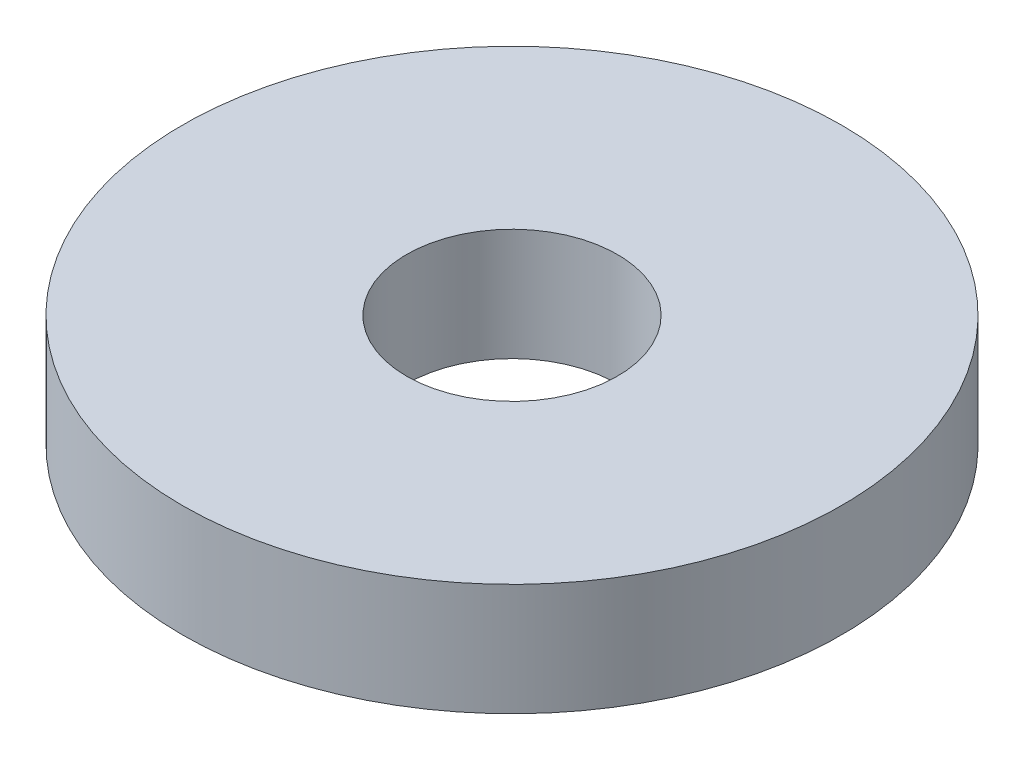
ISO-10303-21;
HEADER;
FILE_DESCRIPTION(('STEP AP214'),'2;1');
FILE_NAME('part.step','',(''),(''),'','','');
FILE_SCHEMA(('AUTOMOTIVE_DESIGN { 1 0 10303 214 1 1 1 1 }'));
ENDSEC;
DATA;
#1=APPLICATION_CONTEXT('core data for automotive mechanical design processes');
#2=APPLICATION_PROTOCOL_DEFINITION('international standard','automotive_design',2000,#1);
#3=PRODUCT_CONTEXT('',#1,'mechanical');
#4=PRODUCT('Part','Part','',(#3));
#5=PRODUCT_RELATED_PRODUCT_CATEGORY('part','',(#4));
#6=PRODUCT_DEFINITION_FORMATION('','',#4);
#7=PRODUCT_DEFINITION_CONTEXT('part definition',#1,'design');
#8=PRODUCT_DEFINITION('design','',#6,#7);
#9=PRODUCT_DEFINITION_SHAPE('','',#8);
#10=(LENGTH_UNIT() NAMED_UNIT(*) SI_UNIT(.MILLI.,.METRE.));
#11=(NAMED_UNIT(*) PLANE_ANGLE_UNIT() SI_UNIT($,.RADIAN.));
#12=(NAMED_UNIT(*) SI_UNIT($,.STERADIAN.) SOLID_ANGLE_UNIT());
#13=UNCERTAINTY_MEASURE_WITH_UNIT(LENGTH_MEASURE(1.E-05),#10,'distance_accuracy_value','');
#14=(GEOMETRIC_REPRESENTATION_CONTEXT(3) GLOBAL_UNCERTAINTY_ASSIGNED_CONTEXT((#13)) GLOBAL_UNIT_ASSIGNED_CONTEXT((#10,
#11,#12)) REPRESENTATION_CONTEXT('',''));
#15=CARTESIAN_POINT('',(0.,0.,0.));
#16=DIRECTION('',(0.,0.,1.));
#17=DIRECTION('',(1.,0.,0.));
#18=AXIS2_PLACEMENT_3D('',#15,#16,#17);
#19=CARTESIAN_POINT('',(0.,1.7,0.));
#20=DIRECTION('',(0.,1.,0.));
#21=DIRECTION('',(0.,0.,1.));
#22=AXIS2_PLACEMENT_3D('',#19,#20,#21);
#23=PLANE('',#22);
#24=CARTESIAN_POINT('',(0.,1.7,0.));
#25=DIRECTION('',(0.,1.,0.));
#26=DIRECTION('',(0.,0.,1.));
#27=AXIS2_PLACEMENT_3D('',#24,#25,#26);
#28=CIRCLE('',#27,5.);
#29=CARTESIAN_POINT('',(0.,1.7,5.));
#30=VERTEX_POINT('',#29);
#31=EDGE_CURVE('E10',#30,#30,#28,.T.);
#32=ORIENTED_EDGE('',*,*,#31,.T.);
#33=EDGE_LOOP('',(#32));
#34=FACE_BOUND('',#33,.T.);
#35=CARTESIAN_POINT('',(0.,1.7,0.));
#36=DIRECTION('',(0.,1.,0.));
#37=DIRECTION('',(0.,0.,1.));
#38=AXIS2_PLACEMENT_3D('',#35,#36,#37);
#39=CIRCLE('',#38,1.6);
#40=CARTESIAN_POINT('',(0.,1.7,1.6));
#41=VERTEX_POINT('',#40);
#42=EDGE_CURVE('E50',#41,#41,#39,.T.);
#43=ORIENTED_EDGE('',*,*,#42,.F.);
#44=EDGE_LOOP('',(#43));
#45=FACE_BOUND('',#44,.T.);
#46=ADVANCED_FACE('F37',(#34,#45),#23,.T.);
#47=CARTESIAN_POINT('',(0.,0.,0.));
#48=DIRECTION('',(0.,1.,0.));
#49=DIRECTION('',(0.,0.,1.));
#50=AXIS2_PLACEMENT_3D('',#47,#48,#49);
#51=PLANE('',#50);
#52=CARTESIAN_POINT('',(0.,0.,0.));
#53=DIRECTION('',(0.,1.,0.));
#54=DIRECTION('',(0.,0.,1.));
#55=AXIS2_PLACEMENT_3D('',#52,#53,#54);
#56=CIRCLE('',#55,5.);
#57=CARTESIAN_POINT('',(0.,0.,5.));
#58=VERTEX_POINT('',#57);
#59=EDGE_CURVE('E41',#58,#58,#56,.T.);
#60=ORIENTED_EDGE('',*,*,#59,.F.);
#61=EDGE_LOOP('',(#60));
#62=FACE_BOUND('',#61,.T.);
#63=CARTESIAN_POINT('',(0.,0.,0.));
#64=DIRECTION('',(0.,1.,0.));
#65=DIRECTION('',(0.,0.,1.));
#66=AXIS2_PLACEMENT_3D('',#63,#64,#65);
#67=CIRCLE('',#66,1.6);
#68=CARTESIAN_POINT('',(0.,0.,1.6));
#69=VERTEX_POINT('',#68);
#70=EDGE_CURVE('E52',#69,#69,#67,.T.);
#71=ORIENTED_EDGE('',*,*,#70,.T.);
#72=EDGE_LOOP('',(#71));
#73=FACE_BOUND('',#72,.T.);
#74=ADVANCED_FACE('F64',(#62,#73),#51,.F.);
#75=CARTESIAN_POINT('',(0.,1.7,0.));
#76=DIRECTION('',(0.,-1.,0.));
#77=DIRECTION('',(0.,0.,-1.));
#78=AXIS2_PLACEMENT_3D('',#75,#76,#77);
#79=CYLINDRICAL_SURFACE('',#78,5.);
#80=ORIENTED_EDGE('',*,*,#31,.F.);
#81=EDGE_LOOP('',(#80));
#82=FACE_BOUND('',#81,.T.);
#83=ORIENTED_EDGE('',*,*,#59,.T.);
#84=EDGE_LOOP('',(#83));
#85=FACE_BOUND('',#84,.T.);
#86=ADVANCED_FACE('F39',(#82,#85),#79,.T.);
#87=CARTESIAN_POINT('',(0.,1.7,0.));
#88=DIRECTION('',(0.,-1.,0.));
#89=DIRECTION('',(0.,0.,-1.));
#90=AXIS2_PLACEMENT_3D('',#87,#88,#89);
#91=CYLINDRICAL_SURFACE('',#90,1.6);
#92=ORIENTED_EDGE('',*,*,#42,.T.);
#93=EDGE_LOOP('',(#92));
#94=FACE_BOUND('',#93,.T.);
#95=ORIENTED_EDGE('',*,*,#70,.F.);
#96=EDGE_LOOP('',(#95));
#97=FACE_BOUND('',#96,.T.);
#98=ADVANCED_FACE('F60',(#94,#97),#91,.F.);
#99=CLOSED_SHELL('',(#46,#74,#86,#98));
#100=MANIFOLD_SOLID_BREP('B2',#99);
#101=ADVANCED_BREP_SHAPE_REPRESENTATION('',(#18,#100),#14);
#102=SHAPE_DEFINITION_REPRESENTATION(#9,#101);
ENDSEC;
END-ISO-10303-21;
